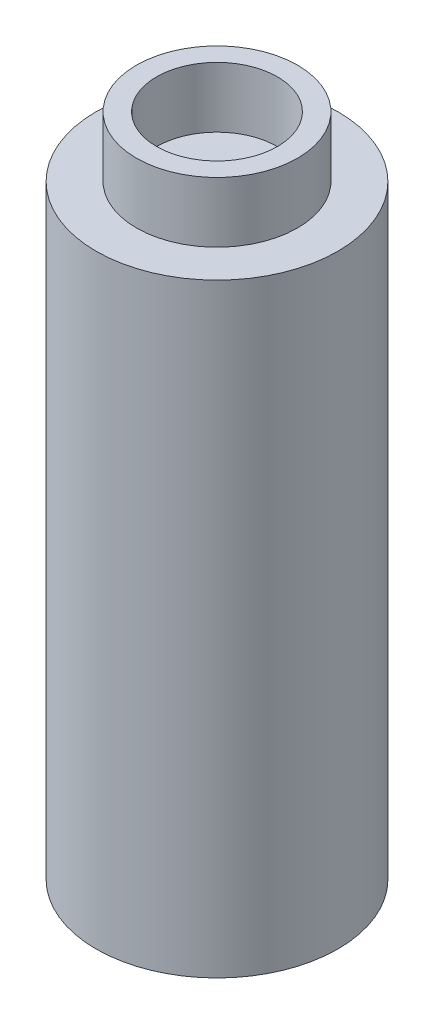
ISO-10303-21;
HEADER;
FILE_DESCRIPTION(('STEP AP214'),'2;1');
FILE_NAME('part.step','',(''),(''),'','','');
FILE_SCHEMA(('AUTOMOTIVE_DESIGN { 1 0 10303 214 1 1 1 1 }'));
ENDSEC;
DATA;
#1=APPLICATION_CONTEXT('core data for automotive mechanical design processes');
#2=APPLICATION_PROTOCOL_DEFINITION('international standard','automotive_design',2000,#1);
#3=PRODUCT_CONTEXT('',#1,'mechanical');
#4=PRODUCT('Part','Part','',(#3));
#5=PRODUCT_RELATED_PRODUCT_CATEGORY('part','',(#4));
#6=PRODUCT_DEFINITION_FORMATION('','',#4);
#7=PRODUCT_DEFINITION_CONTEXT('part definition',#1,'design');
#8=PRODUCT_DEFINITION('design','',#6,#7);
#9=PRODUCT_DEFINITION_SHAPE('','',#8);
#10=(LENGTH_UNIT() NAMED_UNIT(*) SI_UNIT(.MILLI.,.METRE.));
#11=(NAMED_UNIT(*) PLANE_ANGLE_UNIT() SI_UNIT($,.RADIAN.));
#12=(NAMED_UNIT(*) SI_UNIT($,.STERADIAN.) SOLID_ANGLE_UNIT());
#13=UNCERTAINTY_MEASURE_WITH_UNIT(LENGTH_MEASURE(1.E-05),#10,'distance_accuracy_value','');
#14=(GEOMETRIC_REPRESENTATION_CONTEXT(3) GLOBAL_UNCERTAINTY_ASSIGNED_CONTEXT((#13)) GLOBAL_UNIT_ASSIGNED_CONTEXT((#10,
#11,#12)) REPRESENTATION_CONTEXT('',''));
#15=CARTESIAN_POINT('',(0.,0.,0.));
#16=DIRECTION('',(0.,0.,1.));
#17=DIRECTION('',(1.,0.,0.));
#18=AXIS2_PLACEMENT_3D('',#15,#16,#17);
#19=CARTESIAN_POINT('',(0.,30.,0.));
#20=DIRECTION('',(0.,-1.,0.));
#21=DIRECTION('',(0.,0.,-1.));
#22=AXIS2_PLACEMENT_3D('',#19,#20,#21);
#23=CYLINDRICAL_SURFACE('',#22,6.);
#24=CARTESIAN_POINT('',(0.,30.,0.));
#25=DIRECTION('',(0.,1.,0.));
#26=DIRECTION('',(0.,0.,1.));
#27=AXIS2_PLACEMENT_3D('',#24,#25,#26);
#28=CIRCLE('',#27,6.);
#29=CARTESIAN_POINT('',(0.,30.,6.));
#30=VERTEX_POINT('',#29);
#31=EDGE_CURVE('E39',#30,#30,#28,.T.);
#32=ORIENTED_EDGE('',*,*,#31,.F.);
#33=EDGE_LOOP('',(#32));
#34=FACE_BOUND('',#33,.T.);
#35=CARTESIAN_POINT('',(0.,0.,0.));
#36=DIRECTION('',(0.,1.,0.));
#37=DIRECTION('',(0.,0.,1.));
#38=AXIS2_PLACEMENT_3D('',#35,#36,#37);
#39=CIRCLE('',#38,6.);
#40=CARTESIAN_POINT('',(0.,0.,6.));
#41=VERTEX_POINT('',#40);
#42=EDGE_CURVE('E35',#41,#41,#39,.T.);
#43=ORIENTED_EDGE('',*,*,#42,.T.);
#44=EDGE_LOOP('',(#43));
#45=FACE_BOUND('',#44,.T.);
#46=ADVANCED_FACE('F32',(#34,#45),#23,.T.);
#47=CARTESIAN_POINT('',(0.,30.,0.));
#48=DIRECTION('',(0.,1.,0.));
#49=DIRECTION('',(0.,0.,1.));
#50=AXIS2_PLACEMENT_3D('',#47,#48,#49);
#51=PLANE('',#50);
#52=CARTESIAN_POINT('',(0.,30.,0.));
#53=DIRECTION('',(0.,1.,0.));
#54=DIRECTION('',(0.,0.,1.));
#55=AXIS2_PLACEMENT_3D('',#52,#53,#54);
#56=CIRCLE('',#55,4.);
#57=CARTESIAN_POINT('',(0.,30.,4.));
#58=VERTEX_POINT('',#57);
#59=EDGE_CURVE('E10',#58,#58,#56,.T.);
#60=ORIENTED_EDGE('',*,*,#59,.F.);
#61=EDGE_LOOP('',(#60));
#62=FACE_BOUND('',#61,.T.);
#63=ORIENTED_EDGE('',*,*,#31,.T.);
#64=EDGE_LOOP('',(#63));
#65=FACE_BOUND('',#64,.T.);
#66=ADVANCED_FACE('F76',(#62,#65),#51,.T.);
#67=CARTESIAN_POINT('',(0.,0.,0.));
#68=DIRECTION('',(0.,1.,0.));
#69=DIRECTION('',(0.,0.,1.));
#70=AXIS2_PLACEMENT_3D('',#67,#68,#69);
#71=PLANE('',#70);
#72=ORIENTED_EDGE('',*,*,#42,.F.);
#73=EDGE_LOOP('',(#72));
#74=FACE_BOUND('',#73,.T.);
#75=ADVANCED_FACE('F71',(#74),#71,.F.);
#76=CARTESIAN_POINT('',(0.,33.,0.));
#77=DIRECTION('',(0.,-1.,0.));
#78=DIRECTION('',(0.,0.,-1.));
#79=AXIS2_PLACEMENT_3D('',#76,#77,#78);
#80=CYLINDRICAL_SURFACE('',#79,4.);
#81=CARTESIAN_POINT('',(0.,33.,0.));
#82=DIRECTION('',(0.,1.,0.));
#83=DIRECTION('',(0.,0.,1.));
#84=AXIS2_PLACEMENT_3D('',#81,#82,#83);
#85=CIRCLE('',#84,4.);
#86=CARTESIAN_POINT('',(0.,33.,4.));
#87=VERTEX_POINT('',#86);
#88=EDGE_CURVE('E45',#87,#87,#85,.T.);
#89=ORIENTED_EDGE('',*,*,#88,.F.);
#90=EDGE_LOOP('',(#89));
#91=FACE_BOUND('',#90,.T.);
#92=ORIENTED_EDGE('',*,*,#59,.T.);
#93=EDGE_LOOP('',(#92));
#94=FACE_BOUND('',#93,.T.);
#95=ADVANCED_FACE('F66',(#91,#94),#80,.T.);
#96=CARTESIAN_POINT('',(0.,33.,0.));
#97=DIRECTION('',(0.,1.,0.));
#98=DIRECTION('',(0.,0.,1.));
#99=AXIS2_PLACEMENT_3D('',#96,#97,#98);
#100=PLANE('',#99);
#101=CARTESIAN_POINT('',(0.,33.,0.));
#102=DIRECTION('',(0.,1.,0.));
#103=DIRECTION('',(0.,0.,1.));
#104=AXIS2_PLACEMENT_3D('',#101,#102,#103);
#105=CIRCLE('',#104,3.);
#106=CARTESIAN_POINT('',(0.,33.,3.));
#107=VERTEX_POINT('',#106);
#108=EDGE_CURVE('E49',#107,#107,#105,.T.);
#109=ORIENTED_EDGE('',*,*,#108,.F.);
#110=EDGE_LOOP('',(#109));
#111=FACE_BOUND('',#110,.T.);
#112=ORIENTED_EDGE('',*,*,#88,.T.);
#113=EDGE_LOOP('',(#112));
#114=FACE_BOUND('',#113,.T.);
#115=ADVANCED_FACE('F60',(#111,#114),#100,.T.);
#116=CARTESIAN_POINT('',(0.,30.,0.));
#117=DIRECTION('',(0.,1.,0.));
#118=DIRECTION('',(0.,0.,1.));
#119=AXIS2_PLACEMENT_3D('',#116,#117,#118);
#120=CYLINDRICAL_SURFACE('',#119,3.);
#121=CARTESIAN_POINT('',(0.,30.,0.));
#122=DIRECTION('',(0.,1.,0.));
#123=DIRECTION('',(0.,0.,1.));
#124=AXIS2_PLACEMENT_3D('',#121,#122,#123);
#125=CIRCLE('',#124,3.);
#126=CARTESIAN_POINT('',(0.,30.,3.));
#127=VERTEX_POINT('',#126);
#128=EDGE_CURVE('E48',#127,#127,#125,.T.);
#129=ORIENTED_EDGE('',*,*,#128,.F.);
#130=EDGE_LOOP('',(#129));
#131=FACE_BOUND('',#130,.T.);
#132=ORIENTED_EDGE('',*,*,#108,.T.);
#133=EDGE_LOOP('',(#132));
#134=FACE_BOUND('',#133,.T.);
#135=ADVANCED_FACE('F57',(#131,#134),#120,.F.);
#136=CARTESIAN_POINT('',(0.,30.,0.));
#137=DIRECTION('',(0.,1.,0.));
#138=DIRECTION('',(0.,0.,1.));
#139=AXIS2_PLACEMENT_3D('',#136,#137,#138);
#140=PLANE('',#139);
#141=ORIENTED_EDGE('',*,*,#128,.T.);
#142=EDGE_LOOP('',(#141));
#143=FACE_BOUND('',#142,.T.);
#144=ADVANCED_FACE('F55',(#143),#140,.T.);
#145=CLOSED_SHELL('',(#46,#66,#75,#95,#115,#135,#144));
#146=MANIFOLD_SOLID_BREP('B2',#145);
#147=ADVANCED_BREP_SHAPE_REPRESENTATION('',(#18,#146),#14);
#148=SHAPE_DEFINITION_REPRESENTATION(#9,#147);
ENDSEC;
END-ISO-10303-21;
